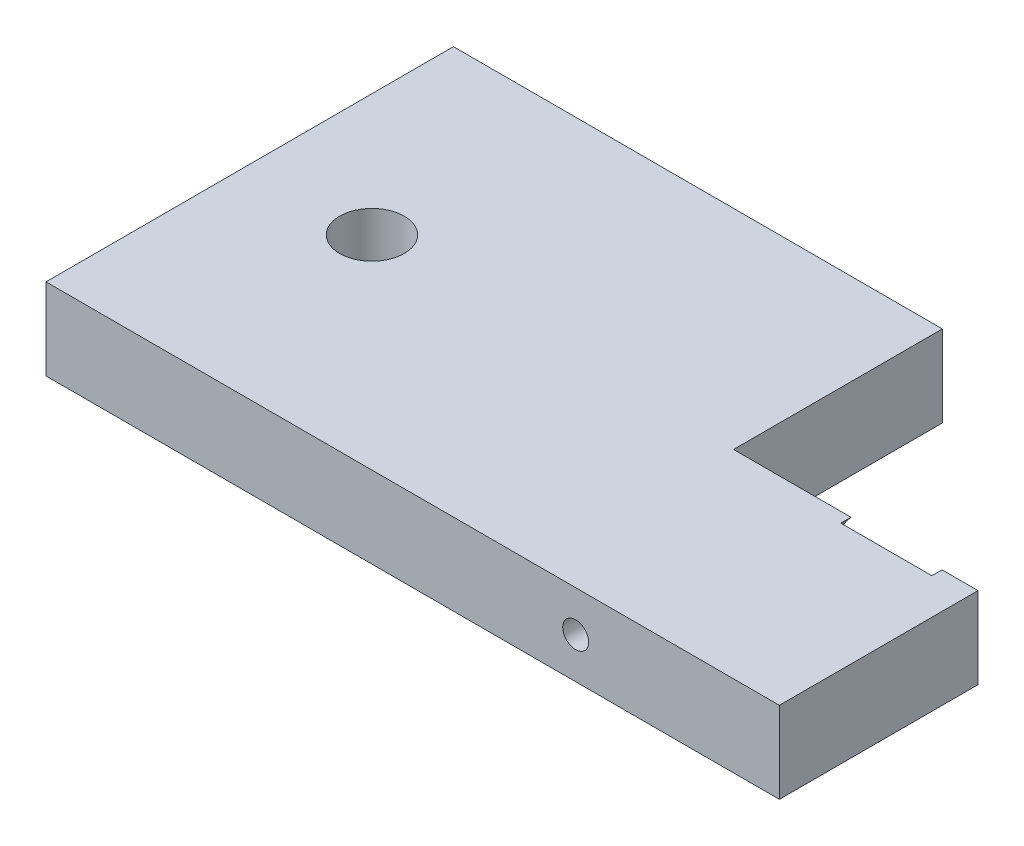
ISO-10303-21;
HEADER;
FILE_DESCRIPTION(('STEP AP214'),'2;1');
FILE_NAME('part.step','',(''),(''),'','','');
FILE_SCHEMA(('AUTOMOTIVE_DESIGN { 1 0 10303 214 1 1 1 1 }'));
ENDSEC;
DATA;
#1=APPLICATION_CONTEXT('core data for automotive mechanical design processes');
#2=APPLICATION_PROTOCOL_DEFINITION('international standard','automotive_design',2000,#1);
#3=PRODUCT_CONTEXT('',#1,'mechanical');
#4=PRODUCT('Part','Part','',(#3));
#5=PRODUCT_RELATED_PRODUCT_CATEGORY('part','',(#4));
#6=PRODUCT_DEFINITION_FORMATION('','',#4);
#7=PRODUCT_DEFINITION_CONTEXT('part definition',#1,'design');
#8=PRODUCT_DEFINITION('design','',#6,#7);
#9=PRODUCT_DEFINITION_SHAPE('','',#8);
#10=(LENGTH_UNIT() NAMED_UNIT(*) SI_UNIT(.MILLI.,.METRE.));
#11=(NAMED_UNIT(*) PLANE_ANGLE_UNIT() SI_UNIT($,.RADIAN.));
#12=(NAMED_UNIT(*) SI_UNIT($,.STERADIAN.) SOLID_ANGLE_UNIT());
#13=UNCERTAINTY_MEASURE_WITH_UNIT(LENGTH_MEASURE(1.E-05),#10,'distance_accuracy_value','');
#14=(GEOMETRIC_REPRESENTATION_CONTEXT(3) GLOBAL_UNCERTAINTY_ASSIGNED_CONTEXT((#13)) GLOBAL_UNIT_ASSIGNED_CONTEXT((#10,
#11,#12)) REPRESENTATION_CONTEXT('',''));
#15=CARTESIAN_POINT('',(0.,0.,0.));
#16=DIRECTION('',(0.,0.,1.));
#17=DIRECTION('',(1.,0.,0.));
#18=AXIS2_PLACEMENT_3D('',#15,#16,#17);
#19=CARTESIAN_POINT('',(-114.3,12.7,0.79375));
#20=DIRECTION('',(0.,0.,1.));
#21=DIRECTION('',(1.,0.,0.));
#22=AXIS2_PLACEMENT_3D('',#19,#20,#21);
#23=PLANE('',#22);
#24=CARTESIAN_POINT('',(-107.95,6.35,0.79375));
#25=DIRECTION('',(0.,0.,-1.));
#26=DIRECTION('',(-1.,0.,0.));
#27=AXIS2_PLACEMENT_3D('',#24,#25,#26);
#28=CIRCLE('',#27,2.01929999999999);
#29=CARTESIAN_POINT('',(-109.9693,6.35,0.79375));
#30=VERTEX_POINT('',#29);
#31=EDGE_CURVE('E203',#30,#30,#28,.T.);
#32=ORIENTED_EDGE('',*,*,#31,.F.);
#33=EDGE_LOOP('',(#32));
#34=FACE_BOUND('',#33,.T.);
#35=DIRECTION('',(-1.,0.,0.));
#36=VECTOR('',#35,1.);
#37=CARTESIAN_POINT('',(-114.3,12.7,0.79375));
#38=LINE('',#37,#36);
#39=CARTESIAN_POINT('',(-95.9995158285617,12.7,0.79375));
#40=VERTEX_POINT('',#39);
#41=CARTESIAN_POINT('',(-114.3,12.7,0.79375));
#42=VERTEX_POINT('',#41);
#43=EDGE_CURVE('E118',#40,#42,#38,.T.);
#44=ORIENTED_EDGE('',*,*,#43,.F.);
#45=CARTESIAN_POINT('',(-88.8999999999999,6.35,0.79375));
#46=DIRECTION('',(0.,0.,-1.));
#47=DIRECTION('',(-1.,0.,0.));
#48=AXIS2_PLACEMENT_3D('',#45,#46,#47);
#49=CIRCLE('',#48,9.52500000000001);
#50=CARTESIAN_POINT('',(-95.9995158285617,0.,0.79375));
#51=VERTEX_POINT('',#50);
#52=EDGE_CURVE('E190',#51,#40,#49,.T.);
#53=ORIENTED_EDGE('',*,*,#52,.F.);
#54=DIRECTION('',(-1.,0.,0.));
#55=VECTOR('',#54,1.);
#56=CARTESIAN_POINT('',(-114.3,0.,0.79375));
#57=LINE('',#56,#55);
#58=CARTESIAN_POINT('',(-114.3,0.,0.79375));
#59=VERTEX_POINT('',#58);
#60=EDGE_CURVE('E149',#51,#59,#57,.T.);
#61=ORIENTED_EDGE('',*,*,#60,.T.);
#62=DIRECTION('',(0.,-1.,0.));
#63=VECTOR('',#62,1.);
#64=CARTESIAN_POINT('',(-114.3,12.7,0.79375));
#65=LINE('',#64,#63);
#66=EDGE_CURVE('E129',#42,#59,#65,.T.);
#67=ORIENTED_EDGE('',*,*,#66,.F.);
#68=EDGE_LOOP('',(#44,#53,#61,#67));
#69=FACE_BOUND('',#68,.T.);
#70=ADVANCED_FACE('F35',(#34,#69),#23,.F.);
#71=CARTESIAN_POINT('',(-190.5,12.7,-31.75));
#72=DIRECTION('',(0.,0.,1.));
#73=DIRECTION('',(1.,0.,0.));
#74=AXIS2_PLACEMENT_3D('',#71,#72,#73);
#75=PLANE('',#74);
#76=DIRECTION('',(-1.,0.,0.));
#77=VECTOR('',#76,1.);
#78=CARTESIAN_POINT('',(-190.5,0.,-31.75));
#79=LINE('',#78,#77);
#80=CARTESIAN_POINT('',(-114.3,0.,-31.75));
#81=VERTEX_POINT('',#80);
#82=CARTESIAN_POINT('',(-190.5,0.,-31.75));
#83=VERTEX_POINT('',#82);
#84=EDGE_CURVE('E140',#81,#83,#79,.T.);
#85=ORIENTED_EDGE('',*,*,#84,.T.);
#86=DIRECTION('',(0.,-1.,0.));
#87=VECTOR('',#86,1.);
#88=CARTESIAN_POINT('',(-190.5,12.7,-31.75));
#89=LINE('',#88,#87);
#90=CARTESIAN_POINT('',(-190.5,12.7,-31.75));
#91=VERTEX_POINT('',#90);
#92=EDGE_CURVE('E160',#91,#83,#89,.T.);
#93=ORIENTED_EDGE('',*,*,#92,.F.);
#94=DIRECTION('',(-1.,0.,0.));
#95=VECTOR('',#94,1.);
#96=CARTESIAN_POINT('',(-190.5,12.7,-31.75));
#97=LINE('',#96,#95);
#98=CARTESIAN_POINT('',(-114.3,12.7,-31.75));
#99=VERTEX_POINT('',#98);
#100=EDGE_CURVE('E153',#99,#91,#97,.T.);
#101=ORIENTED_EDGE('',*,*,#100,.F.);
#102=DIRECTION('',(0.,-1.,0.));
#103=VECTOR('',#102,1.);
#104=CARTESIAN_POINT('',(-114.3,12.7,-31.75));
#105=LINE('',#104,#103);
#106=EDGE_CURVE('E136',#99,#81,#105,.T.);
#107=ORIENTED_EDGE('',*,*,#106,.T.);
#108=EDGE_LOOP('',(#85,#93,#101,#107));
#109=FACE_BOUND('',#108,.T.);
#110=ADVANCED_FACE('F37',(#109),#75,.F.);
#111=CARTESIAN_POINT('',(-190.5,12.7,-31.75));
#112=DIRECTION('',(1.,0.,0.));
#113=DIRECTION('',(0.,0.,-1.));
#114=AXIS2_PLACEMENT_3D('',#111,#112,#113);
#115=PLANE('',#114);
#116=DIRECTION('',(0.,0.,1.));
#117=VECTOR('',#116,1.);
#118=CARTESIAN_POINT('',(-190.5,0.,-31.75));
#119=LINE('',#118,#117);
#120=CARTESIAN_POINT('',(-190.5,0.,31.75));
#121=VERTEX_POINT('',#120);
#122=EDGE_CURVE('E143',#83,#121,#119,.T.);
#123=ORIENTED_EDGE('',*,*,#122,.T.);
#124=DIRECTION('',(0.,-1.,0.));
#125=VECTOR('',#124,1.);
#126=CARTESIAN_POINT('',(-190.5,12.7,31.75));
#127=LINE('',#126,#125);
#128=CARTESIAN_POINT('',(-190.5,12.7,31.75));
#129=VERTEX_POINT('',#128);
#130=EDGE_CURVE('E157',#129,#121,#127,.T.);
#131=ORIENTED_EDGE('',*,*,#130,.F.);
#132=DIRECTION('',(0.,0.,1.));
#133=VECTOR('',#132,1.);
#134=CARTESIAN_POINT('',(-190.5,12.7,-31.75));
#135=LINE('',#134,#133);
#136=EDGE_CURVE('E95',#91,#129,#135,.T.);
#137=ORIENTED_EDGE('',*,*,#136,.F.);
#138=ORIENTED_EDGE('',*,*,#92,.T.);
#139=EDGE_LOOP('',(#123,#131,#137,#138));
#140=FACE_BOUND('',#139,.T.);
#141=ADVANCED_FACE('F211',(#140),#115,.F.);
#142=CARTESIAN_POINT('',(-190.5,12.7,31.75));
#143=DIRECTION('',(0.,0.,-1.));
#144=DIRECTION('',(-1.,0.,0.));
#145=AXIS2_PLACEMENT_3D('',#142,#143,#144);
#146=PLANE('',#145);
#147=CARTESIAN_POINT('',(-107.95,6.35,31.75));
#148=DIRECTION('',(0.,0.,-1.));
#149=DIRECTION('',(-1.,0.,0.));
#150=AXIS2_PLACEMENT_3D('',#147,#148,#149);
#151=CIRCLE('',#150,2.01929999999999);
#152=CARTESIAN_POINT('',(-109.9693,6.35,31.75));
#153=VERTEX_POINT('',#152);
#154=EDGE_CURVE('E144',#153,#153,#151,.T.);
#155=ORIENTED_EDGE('',*,*,#154,.T.);
#156=EDGE_LOOP('',(#155));
#157=FACE_BOUND('',#156,.T.);
#158=DIRECTION('',(1.,0.,0.));
#159=VECTOR('',#158,1.);
#160=CARTESIAN_POINT('',(-190.5,0.,31.75));
#161=LINE('',#160,#159);
#162=CARTESIAN_POINT('',(-76.1999999999999,0.,31.75));
#163=VERTEX_POINT('',#162);
#164=EDGE_CURVE('E146',#121,#163,#161,.T.);
#165=ORIENTED_EDGE('',*,*,#164,.T.);
#166=DIRECTION('',(0.,-1.,0.));
#167=VECTOR('',#166,1.);
#168=CARTESIAN_POINT('',(-76.1999999999999,12.7,31.75));
#169=LINE('',#168,#167);
#170=CARTESIAN_POINT('',(-76.1999999999999,12.7,31.75));
#171=VERTEX_POINT('',#170);
#172=EDGE_CURVE('E128',#171,#163,#169,.T.);
#173=ORIENTED_EDGE('',*,*,#172,.F.);
#174=DIRECTION('',(1.,0.,0.));
#175=VECTOR('',#174,1.);
#176=CARTESIAN_POINT('',(-190.5,12.7,31.75));
#177=LINE('',#176,#175);
#178=EDGE_CURVE('E114',#129,#171,#177,.T.);
#179=ORIENTED_EDGE('',*,*,#178,.F.);
#180=ORIENTED_EDGE('',*,*,#130,.T.);
#181=EDGE_LOOP('',(#165,#173,#179,#180));
#182=FACE_BOUND('',#181,.T.);
#183=ADVANCED_FACE('F214',(#157,#182),#146,.F.);
#184=CARTESIAN_POINT('',(-76.1999999999999,12.7,0.79375));
#185=DIRECTION('',(-1.,0.,0.));
#186=DIRECTION('',(0.,0.,1.));
#187=AXIS2_PLACEMENT_3D('',#184,#185,#186);
#188=PLANE('',#187);
#189=DIRECTION('',(0.,0.,-1.));
#190=VECTOR('',#189,1.);
#191=CARTESIAN_POINT('',(-76.1999999999999,0.,0.79375));
#192=LINE('',#191,#190);
#193=CARTESIAN_POINT('',(-76.1999999999999,0.,0.79375));
#194=VERTEX_POINT('',#193);
#195=EDGE_CURVE('E124',#163,#194,#192,.T.);
#196=ORIENTED_EDGE('',*,*,#195,.T.);
#197=DIRECTION('',(0.,-1.,0.));
#198=VECTOR('',#197,1.);
#199=CARTESIAN_POINT('',(-76.1999999999999,12.7,0.79375));
#200=LINE('',#199,#198);
#201=CARTESIAN_POINT('',(-76.1999999999999,12.7,0.79375));
#202=VERTEX_POINT('',#201);
#203=EDGE_CURVE('E121',#202,#194,#200,.T.);
#204=ORIENTED_EDGE('',*,*,#203,.F.);
#205=DIRECTION('',(0.,0.,-1.));
#206=VECTOR('',#205,1.);
#207=CARTESIAN_POINT('',(-76.1999999999999,12.7,0.79375));
#208=LINE('',#207,#206);
#209=EDGE_CURVE('E105',#171,#202,#208,.T.);
#210=ORIENTED_EDGE('',*,*,#209,.F.);
#211=ORIENTED_EDGE('',*,*,#172,.T.);
#212=EDGE_LOOP('',(#196,#204,#210,#211));
#213=FACE_BOUND('',#212,.T.);
#214=ADVANCED_FACE('F122',(#213),#188,.F.);
#215=CARTESIAN_POINT('',(-81.800484171438,0.,0.79375));
#216=VERTEX_POINT('',#215);
#217=EDGE_CURVE('E150',#194,#216,#57,.T.);
#218=ORIENTED_EDGE('',*,*,#217,.T.);
#219=CARTESIAN_POINT('',(-81.800484171438,12.7,0.79375));
#220=VERTEX_POINT('',#219);
#221=EDGE_CURVE('E134',#220,#216,#49,.T.);
#222=ORIENTED_EDGE('',*,*,#221,.F.);
#223=EDGE_CURVE('E112',#202,#220,#38,.T.);
#224=ORIENTED_EDGE('',*,*,#223,.F.);
#225=ORIENTED_EDGE('',*,*,#203,.T.);
#226=EDGE_LOOP('',(#218,#222,#224,#225));
#227=FACE_BOUND('',#226,.T.);
#228=ADVANCED_FACE('F132',(#227),#23,.F.);
#229=CARTESIAN_POINT('',(-114.3,12.7,-31.75));
#230=DIRECTION('',(-1.,0.,0.));
#231=DIRECTION('',(0.,0.,1.));
#232=AXIS2_PLACEMENT_3D('',#229,#230,#231);
#233=PLANE('',#232);
#234=DIRECTION('',(0.,0.,-1.));
#235=VECTOR('',#234,1.);
#236=CARTESIAN_POINT('',(-114.3,0.,-31.75));
#237=LINE('',#236,#235);
#238=EDGE_CURVE('E86',#59,#81,#237,.T.);
#239=ORIENTED_EDGE('',*,*,#238,.T.);
#240=ORIENTED_EDGE('',*,*,#106,.F.);
#241=DIRECTION('',(0.,0.,-1.));
#242=VECTOR('',#241,1.);
#243=CARTESIAN_POINT('',(-114.3,12.7,-31.75));
#244=LINE('',#243,#242);
#245=EDGE_CURVE('E59',#42,#99,#244,.T.);
#246=ORIENTED_EDGE('',*,*,#245,.F.);
#247=ORIENTED_EDGE('',*,*,#66,.T.);
#248=EDGE_LOOP('',(#239,#240,#246,#247));
#249=FACE_BOUND('',#248,.T.);
#250=ADVANCED_FACE('F224',(#249),#233,.F.);
#251=CARTESIAN_POINT('',(-114.3,12.7,-31.75));
#252=DIRECTION('',(0.,-1.,0.));
#253=DIRECTION('',(0.,0.,-1.));
#254=AXIS2_PLACEMENT_3D('',#251,#252,#253);
#255=PLANE('',#254);
#256=CARTESIAN_POINT('',(-171.45,12.7,0.));
#257=DIRECTION('',(0.,1.,0.));
#258=DIRECTION('',(0.,0.,1.));
#259=AXIS2_PLACEMENT_3D('',#256,#257,#258);
#260=CIRCLE('',#259,5.04189999999999);
#261=CARTESIAN_POINT('',(-171.45,12.7,5.04189999999999));
#262=VERTEX_POINT('',#261);
#263=EDGE_CURVE('E197',#262,#262,#260,.T.);
#264=ORIENTED_EDGE('',*,*,#263,.F.);
#265=EDGE_LOOP('',(#264));
#266=FACE_BOUND('',#265,.T.);
#267=DIRECTION('',(1.,0.,0.));
#268=VECTOR('',#267,1.);
#269=CARTESIAN_POINT('',(-114.3,12.7,2.38125));
#270=LINE('',#269,#268);
#271=CARTESIAN_POINT('',(-95.9995158285617,12.7,2.38125));
#272=VERTEX_POINT('',#271);
#273=CARTESIAN_POINT('',(-81.800484171438,12.7,2.38125));
#274=VERTEX_POINT('',#273);
#275=EDGE_CURVE('E189',#272,#274,#270,.T.);
#276=ORIENTED_EDGE('',*,*,#275,.F.);
#277=DIRECTION('',(0.,0.,-1.));
#278=VECTOR('',#277,1.);
#279=CARTESIAN_POINT('',(-95.9995158285617,12.7,2.38125));
#280=LINE('',#279,#278);
#281=EDGE_CURVE('E187',#272,#40,#280,.T.);
#282=ORIENTED_EDGE('',*,*,#281,.T.);
#283=ORIENTED_EDGE('',*,*,#43,.T.);
#284=ORIENTED_EDGE('',*,*,#245,.T.);
#285=ORIENTED_EDGE('',*,*,#100,.T.);
#286=ORIENTED_EDGE('',*,*,#136,.T.);
#287=ORIENTED_EDGE('',*,*,#178,.T.);
#288=ORIENTED_EDGE('',*,*,#209,.T.);
#289=ORIENTED_EDGE('',*,*,#223,.T.);
#290=DIRECTION('',(0.,0.,-1.));
#291=VECTOR('',#290,1.);
#292=CARTESIAN_POINT('',(-81.800484171438,12.7,2.38125));
#293=LINE('',#292,#291);
#294=EDGE_CURVE('E194',#220,#274,#293,.F.);
#295=ORIENTED_EDGE('',*,*,#294,.T.);
#296=EDGE_LOOP('',(#276,#282,#283,#284,#285,#286,#287,#288,#289,#295));
#297=FACE_BOUND('',#296,.T.);
#298=ADVANCED_FACE('F108',(#266,#297),#255,.F.);
#299=CARTESIAN_POINT('',(-114.3,0.,-31.75));
#300=DIRECTION('',(0.,-1.,0.));
#301=DIRECTION('',(0.,0.,-1.));
#302=AXIS2_PLACEMENT_3D('',#299,#300,#301);
#303=PLANE('',#302);
#304=DIRECTION('',(0.,0.,-1.));
#305=VECTOR('',#304,1.);
#306=CARTESIAN_POINT('',(-95.9995158285617,0.,2.38125));
#307=LINE('',#306,#305);
#308=CARTESIAN_POINT('',(-95.9995158285617,0.,2.38125));
#309=VERTEX_POINT('',#308);
#310=EDGE_CURVE('E11',#309,#51,#307,.T.);
#311=ORIENTED_EDGE('',*,*,#310,.F.);
#312=DIRECTION('',(1.,0.,0.));
#313=VECTOR('',#312,1.);
#314=CARTESIAN_POINT('',(-114.3,0.,2.38125));
#315=LINE('',#314,#313);
#316=CARTESIAN_POINT('',(-81.800484171438,0.,2.38125));
#317=VERTEX_POINT('',#316);
#318=EDGE_CURVE('E162',#309,#317,#315,.T.);
#319=ORIENTED_EDGE('',*,*,#318,.T.);
#320=DIRECTION('',(0.,0.,-1.));
#321=VECTOR('',#320,1.);
#322=CARTESIAN_POINT('',(-81.800484171438,0.,2.38125));
#323=LINE('',#322,#321);
#324=EDGE_CURVE('E43',#216,#317,#323,.F.);
#325=ORIENTED_EDGE('',*,*,#324,.F.);
#326=ORIENTED_EDGE('',*,*,#217,.F.);
#327=ORIENTED_EDGE('',*,*,#195,.F.);
#328=ORIENTED_EDGE('',*,*,#164,.F.);
#329=ORIENTED_EDGE('',*,*,#122,.F.);
#330=ORIENTED_EDGE('',*,*,#84,.F.);
#331=ORIENTED_EDGE('',*,*,#238,.F.);
#332=ORIENTED_EDGE('',*,*,#60,.F.);
#333=EDGE_LOOP('',(#311,#319,#325,#326,#327,#328,#329,#330,#331,#332));
#334=FACE_BOUND('',#333,.T.);
#335=CARTESIAN_POINT('',(-171.45,0.,0.));
#336=DIRECTION('',(0.,1.,0.));
#337=DIRECTION('',(0.,0.,1.));
#338=AXIS2_PLACEMENT_3D('',#335,#336,#337);
#339=CIRCLE('',#338,5.04189999999999);
#340=CARTESIAN_POINT('',(-171.45,0.,5.04189999999999));
#341=VERTEX_POINT('',#340);
#342=EDGE_CURVE('E200',#341,#341,#339,.T.);
#343=ORIENTED_EDGE('',*,*,#342,.T.);
#344=EDGE_LOOP('',(#343));
#345=FACE_BOUND('',#344,.T.);
#346=ADVANCED_FACE('F172',(#334,#345),#303,.T.);
#347=CARTESIAN_POINT('',(-107.95,6.35,0.79375));
#348=DIRECTION('',(0.,0.,-1.));
#349=DIRECTION('',(-1.,0.,0.));
#350=AXIS2_PLACEMENT_3D('',#347,#348,#349);
#351=CYLINDRICAL_SURFACE('',#350,2.01929999999999);
#352=ORIENTED_EDGE('',*,*,#154,.F.);
#353=EDGE_LOOP('',(#352));
#354=FACE_BOUND('',#353,.T.);
#355=ORIENTED_EDGE('',*,*,#31,.T.);
#356=EDGE_LOOP('',(#355));
#357=FACE_BOUND('',#356,.T.);
#358=ADVANCED_FACE('F253',(#354,#357),#351,.F.);
#359=CARTESIAN_POINT('',(-171.45,12.7,0.));
#360=DIRECTION('',(0.,1.,0.));
#361=DIRECTION('',(0.,0.,1.));
#362=AXIS2_PLACEMENT_3D('',#359,#360,#361);
#363=CYLINDRICAL_SURFACE('',#362,5.04189999999999);
#364=ORIENTED_EDGE('',*,*,#342,.F.);
#365=EDGE_LOOP('',(#364));
#366=FACE_BOUND('',#365,.T.);
#367=ORIENTED_EDGE('',*,*,#263,.T.);
#368=EDGE_LOOP('',(#367));
#369=FACE_BOUND('',#368,.T.);
#370=ADVANCED_FACE('F256',(#366,#369),#363,.F.);
#371=CARTESIAN_POINT('',(-88.8999999999999,6.35,2.38125));
#372=DIRECTION('',(0.,0.,-1.));
#373=DIRECTION('',(-1.,0.,0.));
#374=AXIS2_PLACEMENT_3D('',#371,#372,#373);
#375=CYLINDRICAL_SURFACE('',#374,9.52500000000001);
#376=CARTESIAN_POINT('',(-88.8999999999999,6.35,2.38125));
#377=DIRECTION('',(0.,0.,-1.));
#378=DIRECTION('',(-1.,0.,0.));
#379=AXIS2_PLACEMENT_3D('',#376,#377,#378);
#380=CIRCLE('',#379,9.52500000000001);
#381=EDGE_CURVE('E179',#309,#272,#380,.T.);
#382=ORIENTED_EDGE('',*,*,#381,.F.);
#383=ORIENTED_EDGE('',*,*,#310,.T.);
#384=ORIENTED_EDGE('',*,*,#52,.T.);
#385=ORIENTED_EDGE('',*,*,#281,.F.);
#386=EDGE_LOOP('',(#382,#383,#384,#385));
#387=FACE_BOUND('',#386,.T.);
#388=ADVANCED_FACE('F182',(#387),#375,.F.);
#389=ORIENTED_EDGE('',*,*,#221,.T.);
#390=ORIENTED_EDGE('',*,*,#324,.T.);
#391=EDGE_CURVE('E50',#274,#317,#380,.T.);
#392=ORIENTED_EDGE('',*,*,#391,.F.);
#393=ORIENTED_EDGE('',*,*,#294,.F.);
#394=EDGE_LOOP('',(#389,#390,#392,#393));
#395=FACE_BOUND('',#394,.T.);
#396=ADVANCED_FACE('F166',(#395),#375,.F.);
#397=CARTESIAN_POINT('',(-88.8999999999999,6.35,2.38125));
#398=DIRECTION('',(0.,0.,-1.));
#399=DIRECTION('',(-1.,0.,0.));
#400=AXIS2_PLACEMENT_3D('',#397,#398,#399);
#401=PLANE('',#400);
#402=ORIENTED_EDGE('',*,*,#275,.T.);
#403=ORIENTED_EDGE('',*,*,#391,.T.);
#404=ORIENTED_EDGE('',*,*,#318,.F.);
#405=ORIENTED_EDGE('',*,*,#381,.T.);
#406=EDGE_LOOP('',(#402,#403,#404,#405));
#407=FACE_BOUND('',#406,.T.);
#408=ADVANCED_FACE('F177',(#407),#401,.T.);
#409=CLOSED_SHELL('',(#70,#110,#141,#183,#214,#228,#250,#298,#346,#358,#370,#388,#396,#408));
#410=MANIFOLD_SOLID_BREP('B2',#409);
#411=ADVANCED_BREP_SHAPE_REPRESENTATION('',(#18,#410),#14);
#412=SHAPE_DEFINITION_REPRESENTATION(#9,#411);
ENDSEC;
END-ISO-10303-21;
